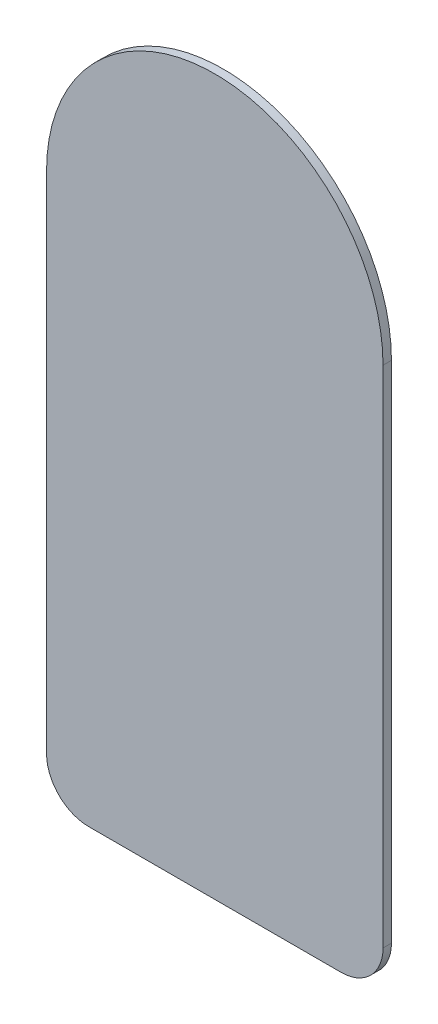
ISO-10303-21;
HEADER;
FILE_DESCRIPTION(('STEP AP214'),'2;1');
FILE_NAME('part.step','',(''),(''),'','','');
FILE_SCHEMA(('AUTOMOTIVE_DESIGN { 1 0 10303 214 1 1 1 1 }'));
ENDSEC;
DATA;
#1=APPLICATION_CONTEXT('core data for automotive mechanical design processes');
#2=APPLICATION_PROTOCOL_DEFINITION('international standard','automotive_design',2000,#1);
#3=PRODUCT_CONTEXT('',#1,'mechanical');
#4=PRODUCT('Part','Part','',(#3));
#5=PRODUCT_RELATED_PRODUCT_CATEGORY('part','',(#4));
#6=PRODUCT_DEFINITION_FORMATION('','',#4);
#7=PRODUCT_DEFINITION_CONTEXT('part definition',#1,'design');
#8=PRODUCT_DEFINITION('design','',#6,#7);
#9=PRODUCT_DEFINITION_SHAPE('','',#8);
#10=(LENGTH_UNIT() NAMED_UNIT(*) SI_UNIT(.MILLI.,.METRE.));
#11=(NAMED_UNIT(*) PLANE_ANGLE_UNIT() SI_UNIT($,.RADIAN.));
#12=(NAMED_UNIT(*) SI_UNIT($,.STERADIAN.) SOLID_ANGLE_UNIT());
#13=UNCERTAINTY_MEASURE_WITH_UNIT(LENGTH_MEASURE(1.E-05),#10,'distance_accuracy_value','');
#14=(GEOMETRIC_REPRESENTATION_CONTEXT(3) GLOBAL_UNCERTAINTY_ASSIGNED_CONTEXT((#13)) GLOBAL_UNIT_ASSIGNED_CONTEXT((#10,
#11,#12)) REPRESENTATION_CONTEXT('',''));
#15=CARTESIAN_POINT('',(0.,0.,0.));
#16=DIRECTION('',(0.,0.,1.));
#17=DIRECTION('',(1.,0.,0.));
#18=AXIS2_PLACEMENT_3D('',#15,#16,#17);
#19=CARTESIAN_POINT('',(0.,0.,0.508));
#20=DIRECTION('',(0.,0.,-1.));
#21=DIRECTION('',(-1.,0.,0.));
#22=AXIS2_PLACEMENT_3D('',#19,#20,#21);
#23=CYLINDRICAL_SURFACE('',#22,10.16);
#24=CARTESIAN_POINT('',(0.,0.,0.));
#25=DIRECTION('',(0.,0.,1.));
#26=DIRECTION('',(1.,0.,0.));
#27=AXIS2_PLACEMENT_3D('',#24,#25,#26);
#28=CIRCLE('',#27,10.16);
#29=CARTESIAN_POINT('',(10.16,2.47198095326695E-13,0.));
#30=VERTEX_POINT('',#29);
#31=CARTESIAN_POINT('',(-10.16,-2.45463371850718E-13,0.));
#32=VERTEX_POINT('',#31);
#33=EDGE_CURVE('E117',#30,#32,#28,.T.);
#34=ORIENTED_EDGE('',*,*,#33,.T.);
#35=DIRECTION('',(0.,0.,-1.));
#36=VECTOR('',#35,1.);
#37=CARTESIAN_POINT('',(-10.16,-2.45463371850718E-13,0.508));
#38=LINE('',#37,#36);
#39=CARTESIAN_POINT('',(-10.16,-2.45463371850718E-13,0.508));
#40=VERTEX_POINT('',#39);
#41=EDGE_CURVE('E11',#40,#32,#38,.T.);
#42=ORIENTED_EDGE('',*,*,#41,.F.);
#43=CARTESIAN_POINT('',(0.,0.,0.508));
#44=DIRECTION('',(0.,0.,1.));
#45=DIRECTION('',(1.,0.,0.));
#46=AXIS2_PLACEMENT_3D('',#43,#44,#45);
#47=CIRCLE('',#46,10.16);
#48=CARTESIAN_POINT('',(10.16,2.47198095326695E-13,0.508));
#49=VERTEX_POINT('',#48);
#50=EDGE_CURVE('E127',#49,#40,#47,.T.);
#51=ORIENTED_EDGE('',*,*,#50,.F.);
#52=DIRECTION('',(0.,0.,-1.));
#53=VECTOR('',#52,1.);
#54=CARTESIAN_POINT('',(10.16,2.47198095326695E-13,0.508));
#55=LINE('',#54,#53);
#56=EDGE_CURVE('E113',#49,#30,#55,.T.);
#57=ORIENTED_EDGE('',*,*,#56,.T.);
#58=EDGE_LOOP('',(#34,#42,#51,#57));
#59=FACE_BOUND('',#58,.T.);
#60=ADVANCED_FACE('F33',(#59),#23,.T.);
#61=CARTESIAN_POINT('',(-10.16,-2.45463371850718E-13,0.508));
#62=DIRECTION('',(1.,0.,0.));
#63=DIRECTION('',(0.,1.,0.));
#64=AXIS2_PLACEMENT_3D('',#61,#62,#63);
#65=PLANE('',#64);
#66=DIRECTION('',(0.,-1.,0.));
#67=VECTOR('',#66,1.);
#68=CARTESIAN_POINT('',(-10.16,-2.45463371850718E-13,0.));
#69=LINE('',#68,#67);
#70=CARTESIAN_POINT('',(-10.1599999999993,-30.4800000000002,0.));
#71=VERTEX_POINT('',#70);
#72=EDGE_CURVE('E120',#32,#71,#69,.T.);
#73=ORIENTED_EDGE('',*,*,#72,.T.);
#74=DIRECTION('',(0.,0.,-1.));
#75=VECTOR('',#74,1.);
#76=CARTESIAN_POINT('',(-10.1599999999993,-30.4800000000002,0.508));
#77=LINE('',#76,#75);
#78=CARTESIAN_POINT('',(-10.1599999999993,-30.4800000000002,0.508));
#79=VERTEX_POINT('',#78);
#80=EDGE_CURVE('E41',#79,#71,#77,.T.);
#81=ORIENTED_EDGE('',*,*,#80,.F.);
#82=DIRECTION('',(0.,-1.,0.));
#83=VECTOR('',#82,1.);
#84=CARTESIAN_POINT('',(-10.16,-2.45463371850718E-13,0.508));
#85=LINE('',#84,#83);
#86=EDGE_CURVE('E86',#40,#79,#85,.T.);
#87=ORIENTED_EDGE('',*,*,#86,.F.);
#88=ORIENTED_EDGE('',*,*,#41,.T.);
#89=EDGE_LOOP('',(#73,#81,#87,#88));
#90=FACE_BOUND('',#89,.T.);
#91=ADVANCED_FACE('F151',(#90),#65,.F.);
#92=CARTESIAN_POINT('',(-7.61999999999926,-30.4800000000002,0.508));
#93=DIRECTION('',(0.,0.,-1.));
#94=DIRECTION('',(-1.,0.,0.));
#95=AXIS2_PLACEMENT_3D('',#92,#93,#94);
#96=CYLINDRICAL_SURFACE('',#95,2.54);
#97=CARTESIAN_POINT('',(-7.61999999999926,-30.4800000000002,0.));
#98=DIRECTION('',(0.,0.,1.));
#99=DIRECTION('',(1.,0.,0.));
#100=AXIS2_PLACEMENT_3D('',#97,#98,#99);
#101=CIRCLE('',#100,2.54);
#102=CARTESIAN_POINT('',(-7.61999999999918,-33.0200000000002,0.));
#103=VERTEX_POINT('',#102);
#104=EDGE_CURVE('E122',#71,#103,#101,.T.);
#105=ORIENTED_EDGE('',*,*,#104,.T.);
#106=DIRECTION('',(0.,0.,-1.));
#107=VECTOR('',#106,1.);
#108=CARTESIAN_POINT('',(-7.61999999999918,-33.0200000000002,0.508));
#109=LINE('',#108,#107);
#110=CARTESIAN_POINT('',(-7.61999999999918,-33.0200000000002,0.508));
#111=VERTEX_POINT('',#110);
#112=EDGE_CURVE('E108',#111,#103,#109,.T.);
#113=ORIENTED_EDGE('',*,*,#112,.F.);
#114=CARTESIAN_POINT('',(-7.61999999999926,-30.4800000000002,0.508));
#115=DIRECTION('',(0.,0.,1.));
#116=DIRECTION('',(1.,0.,0.));
#117=AXIS2_PLACEMENT_3D('',#114,#115,#116);
#118=CIRCLE('',#117,2.54);
#119=EDGE_CURVE('E99',#79,#111,#118,.T.);
#120=ORIENTED_EDGE('',*,*,#119,.F.);
#121=ORIENTED_EDGE('',*,*,#80,.T.);
#122=EDGE_LOOP('',(#105,#113,#120,#121));
#123=FACE_BOUND('',#122,.T.);
#124=ADVANCED_FACE('F133',(#123),#96,.T.);
#125=CARTESIAN_POINT('',(-7.61999999999918,-33.0200000000002,0.508));
#126=DIRECTION('',(0.,1.,0.));
#127=DIRECTION('',(-1.,0.,0.));
#128=AXIS2_PLACEMENT_3D('',#125,#126,#127);
#129=PLANE('',#128);
#130=DIRECTION('',(1.,0.,0.));
#131=VECTOR('',#130,1.);
#132=CARTESIAN_POINT('',(-7.61999999999918,-33.0200000000002,0.));
#133=LINE('',#132,#131);
#134=CARTESIAN_POINT('',(7.62000000000078,-33.0199999999998,0.));
#135=VERTEX_POINT('',#134);
#136=EDGE_CURVE('E107',#103,#135,#133,.T.);
#137=ORIENTED_EDGE('',*,*,#136,.T.);
#138=DIRECTION('',(0.,0.,-1.));
#139=VECTOR('',#138,1.);
#140=CARTESIAN_POINT('',(7.62000000000078,-33.0199999999998,0.508));
#141=LINE('',#140,#139);
#142=CARTESIAN_POINT('',(7.62000000000078,-33.0199999999998,0.508));
#143=VERTEX_POINT('',#142);
#144=EDGE_CURVE('E104',#143,#135,#141,.T.);
#145=ORIENTED_EDGE('',*,*,#144,.F.);
#146=DIRECTION('',(1.,0.,0.));
#147=VECTOR('',#146,1.);
#148=CARTESIAN_POINT('',(-7.61999999999918,-33.0200000000002,0.508));
#149=LINE('',#148,#147);
#150=EDGE_CURVE('E93',#111,#143,#149,.T.);
#151=ORIENTED_EDGE('',*,*,#150,.F.);
#152=ORIENTED_EDGE('',*,*,#112,.T.);
#153=EDGE_LOOP('',(#137,#145,#151,#152));
#154=FACE_BOUND('',#153,.T.);
#155=ADVANCED_FACE('F105',(#154),#129,.F.);
#156=CARTESIAN_POINT('',(7.62000000000074,-30.4799999999998,0.508));
#157=DIRECTION('',(0.,0.,-1.));
#158=DIRECTION('',(-1.,0.,0.));
#159=AXIS2_PLACEMENT_3D('',#156,#157,#158);
#160=CYLINDRICAL_SURFACE('',#159,2.54);
#161=CARTESIAN_POINT('',(7.62000000000074,-30.4799999999998,0.));
#162=DIRECTION('',(0.,0.,1.));
#163=DIRECTION('',(1.,0.,0.));
#164=AXIS2_PLACEMENT_3D('',#161,#162,#163);
#165=CIRCLE('',#164,2.54);
#166=CARTESIAN_POINT('',(10.1600000000007,-30.4799999999997,0.));
#167=VERTEX_POINT('',#166);
#168=EDGE_CURVE('E72',#135,#167,#165,.T.);
#169=ORIENTED_EDGE('',*,*,#168,.T.);
#170=DIRECTION('',(0.,0.,-1.));
#171=VECTOR('',#170,1.);
#172=CARTESIAN_POINT('',(10.1600000000007,-30.4799999999997,0.508));
#173=LINE('',#172,#171);
#174=CARTESIAN_POINT('',(10.1600000000007,-30.4799999999997,0.508));
#175=VERTEX_POINT('',#174);
#176=EDGE_CURVE('E109',#175,#167,#173,.T.);
#177=ORIENTED_EDGE('',*,*,#176,.F.);
#178=CARTESIAN_POINT('',(7.62000000000074,-30.4799999999998,0.508));
#179=DIRECTION('',(0.,0.,1.));
#180=DIRECTION('',(1.,0.,0.));
#181=AXIS2_PLACEMENT_3D('',#178,#179,#180);
#182=CIRCLE('',#181,2.54);
#183=EDGE_CURVE('E97',#143,#175,#182,.T.);
#184=ORIENTED_EDGE('',*,*,#183,.F.);
#185=ORIENTED_EDGE('',*,*,#144,.T.);
#186=EDGE_LOOP('',(#169,#177,#184,#185));
#187=FACE_BOUND('',#186,.T.);
#188=ADVANCED_FACE('F111',(#187),#160,.T.);
#189=CARTESIAN_POINT('',(10.1600000000007,-30.4799999999997,0.508));
#190=DIRECTION('',(-1.,0.,0.));
#191=DIRECTION('',(0.,-1.,0.));
#192=AXIS2_PLACEMENT_3D('',#189,#190,#191);
#193=PLANE('',#192);
#194=DIRECTION('',(0.,1.,0.));
#195=VECTOR('',#194,1.);
#196=CARTESIAN_POINT('',(10.1600000000007,-30.4799999999997,0.));
#197=LINE('',#196,#195);
#198=EDGE_CURVE('E78',#167,#30,#197,.T.);
#199=ORIENTED_EDGE('',*,*,#198,.T.);
#200=ORIENTED_EDGE('',*,*,#56,.F.);
#201=DIRECTION('',(0.,1.,0.));
#202=VECTOR('',#201,1.);
#203=CARTESIAN_POINT('',(10.1600000000007,-30.4799999999997,0.508));
#204=LINE('',#203,#202);
#205=EDGE_CURVE('E49',#175,#49,#204,.T.);
#206=ORIENTED_EDGE('',*,*,#205,.F.);
#207=ORIENTED_EDGE('',*,*,#176,.T.);
#208=EDGE_LOOP('',(#199,#200,#206,#207));
#209=FACE_BOUND('',#208,.T.);
#210=ADVANCED_FACE('F140',(#209),#193,.F.);
#211=CARTESIAN_POINT('',(0.,0.,0.508));
#212=DIRECTION('',(0.,0.,1.));
#213=DIRECTION('',(1.,0.,0.));
#214=AXIS2_PLACEMENT_3D('',#211,#212,#213);
#215=PLANE('',#214);
#216=ORIENTED_EDGE('',*,*,#50,.T.);
#217=ORIENTED_EDGE('',*,*,#86,.T.);
#218=ORIENTED_EDGE('',*,*,#119,.T.);
#219=ORIENTED_EDGE('',*,*,#150,.T.);
#220=ORIENTED_EDGE('',*,*,#183,.T.);
#221=ORIENTED_EDGE('',*,*,#205,.T.);
#222=EDGE_LOOP('',(#216,#217,#218,#219,#220,#221));
#223=FACE_BOUND('',#222,.T.);
#224=ADVANCED_FACE('F95',(#223),#215,.T.);
#225=CARTESIAN_POINT('',(0.,0.,0.));
#226=DIRECTION('',(0.,0.,1.));
#227=DIRECTION('',(1.,0.,0.));
#228=AXIS2_PLACEMENT_3D('',#225,#226,#227);
#229=PLANE('',#228);
#230=ORIENTED_EDGE('',*,*,#33,.F.);
#231=ORIENTED_EDGE('',*,*,#198,.F.);
#232=ORIENTED_EDGE('',*,*,#168,.F.);
#233=ORIENTED_EDGE('',*,*,#136,.F.);
#234=ORIENTED_EDGE('',*,*,#104,.F.);
#235=ORIENTED_EDGE('',*,*,#72,.F.);
#236=EDGE_LOOP('',(#230,#231,#232,#233,#234,#235));
#237=FACE_BOUND('',#236,.T.);
#238=ADVANCED_FACE('F136',(#237),#229,.F.);
#239=CLOSED_SHELL('',(#60,#91,#124,#155,#188,#210,#224,#238));
#240=MANIFOLD_SOLID_BREP('B2',#239);
#241=ADVANCED_BREP_SHAPE_REPRESENTATION('',(#18,#240),#14);
#242=SHAPE_DEFINITION_REPRESENTATION(#9,#241);
ENDSEC;
END-ISO-10303-21;
